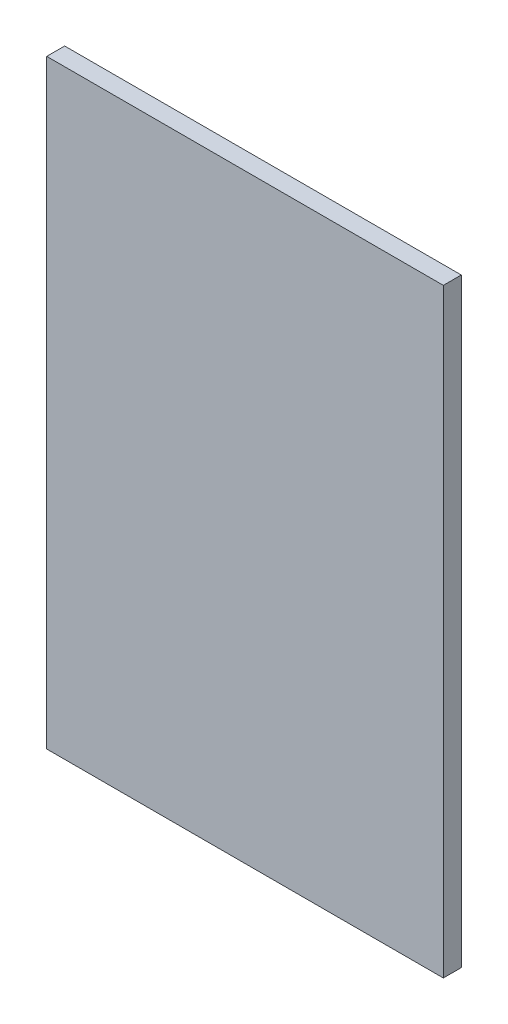
ISO-10303-21;
HEADER;
FILE_DESCRIPTION(('STEP AP214'),'2;1');
FILE_NAME('part.step','',(''),(''),'','','');
FILE_SCHEMA(('AUTOMOTIVE_DESIGN { 1 0 10303 214 1 1 1 1 }'));
ENDSEC;
DATA;
#1=APPLICATION_CONTEXT('core data for automotive mechanical design processes');
#2=APPLICATION_PROTOCOL_DEFINITION('international standard','automotive_design',2000,#1);
#3=PRODUCT_CONTEXT('',#1,'mechanical');
#4=PRODUCT('Part','Part','',(#3));
#5=PRODUCT_RELATED_PRODUCT_CATEGORY('part','',(#4));
#6=PRODUCT_DEFINITION_FORMATION('','',#4);
#7=PRODUCT_DEFINITION_CONTEXT('part definition',#1,'design');
#8=PRODUCT_DEFINITION('design','',#6,#7);
#9=PRODUCT_DEFINITION_SHAPE('','',#8);
#10=(LENGTH_UNIT() NAMED_UNIT(*) SI_UNIT(.MILLI.,.METRE.));
#11=(NAMED_UNIT(*) PLANE_ANGLE_UNIT() SI_UNIT($,.RADIAN.));
#12=(NAMED_UNIT(*) SI_UNIT($,.STERADIAN.) SOLID_ANGLE_UNIT());
#13=UNCERTAINTY_MEASURE_WITH_UNIT(LENGTH_MEASURE(1.E-05),#10,'distance_accuracy_value','');
#14=(GEOMETRIC_REPRESENTATION_CONTEXT(3) GLOBAL_UNCERTAINTY_ASSIGNED_CONTEXT((#13)) GLOBAL_UNIT_ASSIGNED_CONTEXT((#10,
#11,#12)) REPRESENTATION_CONTEXT('',''));
#15=CARTESIAN_POINT('',(0.,0.,0.));
#16=DIRECTION('',(0.,0.,1.));
#17=DIRECTION('',(1.,0.,0.));
#18=AXIS2_PLACEMENT_3D('',#15,#16,#17);
#19=CARTESIAN_POINT('',(-199.,-301.,18.));
#20=DIRECTION('',(1.,0.,0.));
#21=DIRECTION('',(0.,0.,-1.));
#22=AXIS2_PLACEMENT_3D('',#19,#20,#21);
#23=PLANE('',#22);
#24=DIRECTION('',(0.,-1.,0.));
#25=VECTOR('',#24,1.);
#26=CARTESIAN_POINT('',(-199.,-301.,0.));
#27=LINE('',#26,#25);
#28=CARTESIAN_POINT('',(-199.,301.,0.));
#29=VERTEX_POINT('',#28);
#30=CARTESIAN_POINT('',(-199.,-301.,0.));
#31=VERTEX_POINT('',#30);
#32=EDGE_CURVE('E95',#29,#31,#27,.T.);
#33=ORIENTED_EDGE('',*,*,#32,.T.);
#34=DIRECTION('',(0.,0.,-1.));
#35=VECTOR('',#34,1.);
#36=CARTESIAN_POINT('',(-199.,-301.,18.));
#37=LINE('',#36,#35);
#38=CARTESIAN_POINT('',(-199.,-301.,18.));
#39=VERTEX_POINT('',#38);
#40=EDGE_CURVE('E11',#39,#31,#37,.T.);
#41=ORIENTED_EDGE('',*,*,#40,.F.);
#42=DIRECTION('',(0.,-1.,0.));
#43=VECTOR('',#42,1.);
#44=CARTESIAN_POINT('',(-199.,-301.,18.));
#45=LINE('',#44,#43);
#46=CARTESIAN_POINT('',(-199.,301.,18.));
#47=VERTEX_POINT('',#46);
#48=EDGE_CURVE('E83',#47,#39,#45,.T.);
#49=ORIENTED_EDGE('',*,*,#48,.F.);
#50=DIRECTION('',(0.,0.,-1.));
#51=VECTOR('',#50,1.);
#52=CARTESIAN_POINT('',(-199.,301.,18.));
#53=LINE('',#52,#51);
#54=EDGE_CURVE('E91',#47,#29,#53,.T.);
#55=ORIENTED_EDGE('',*,*,#54,.T.);
#56=EDGE_LOOP('',(#33,#41,#49,#55));
#57=FACE_BOUND('',#56,.T.);
#58=ADVANCED_FACE('F32',(#57),#23,.F.);
#59=CARTESIAN_POINT('',(199.,-301.,18.));
#60=DIRECTION('',(0.,1.,0.));
#61=DIRECTION('',(0.,0.,1.));
#62=AXIS2_PLACEMENT_3D('',#59,#60,#61);
#63=PLANE('',#62);
#64=DIRECTION('',(1.,0.,0.));
#65=VECTOR('',#64,1.);
#66=CARTESIAN_POINT('',(199.,-301.,0.));
#67=LINE('',#66,#65);
#68=CARTESIAN_POINT('',(199.,-301.,0.));
#69=VERTEX_POINT('',#68);
#70=EDGE_CURVE('E87',#31,#69,#67,.T.);
#71=ORIENTED_EDGE('',*,*,#70,.T.);
#72=DIRECTION('',(0.,0.,-1.));
#73=VECTOR('',#72,1.);
#74=CARTESIAN_POINT('',(199.,-301.,18.));
#75=LINE('',#74,#73);
#76=CARTESIAN_POINT('',(199.,-301.,18.));
#77=VERTEX_POINT('',#76);
#78=EDGE_CURVE('E40',#77,#69,#75,.T.);
#79=ORIENTED_EDGE('',*,*,#78,.F.);
#80=DIRECTION('',(1.,0.,0.));
#81=VECTOR('',#80,1.);
#82=CARTESIAN_POINT('',(199.,-301.,18.));
#83=LINE('',#82,#81);
#84=EDGE_CURVE('E78',#39,#77,#83,.T.);
#85=ORIENTED_EDGE('',*,*,#84,.F.);
#86=ORIENTED_EDGE('',*,*,#40,.T.);
#87=EDGE_LOOP('',(#71,#79,#85,#86));
#88=FACE_BOUND('',#87,.T.);
#89=ADVANCED_FACE('F86',(#88),#63,.F.);
#90=CARTESIAN_POINT('',(199.,-301.,18.));
#91=DIRECTION('',(-1.,0.,0.));
#92=DIRECTION('',(0.,0.,1.));
#93=AXIS2_PLACEMENT_3D('',#90,#91,#92);
#94=PLANE('',#93);
#95=DIRECTION('',(0.,1.,0.));
#96=VECTOR('',#95,1.);
#97=CARTESIAN_POINT('',(199.,-301.,0.));
#98=LINE('',#97,#96);
#99=CARTESIAN_POINT('',(199.,301.,0.));
#100=VERTEX_POINT('',#99);
#101=EDGE_CURVE('E65',#69,#100,#98,.T.);
#102=ORIENTED_EDGE('',*,*,#101,.T.);
#103=DIRECTION('',(0.,0.,-1.));
#104=VECTOR('',#103,1.);
#105=CARTESIAN_POINT('',(199.,301.,18.));
#106=LINE('',#105,#104);
#107=CARTESIAN_POINT('',(199.,301.,18.));
#108=VERTEX_POINT('',#107);
#109=EDGE_CURVE('E88',#108,#100,#106,.T.);
#110=ORIENTED_EDGE('',*,*,#109,.F.);
#111=DIRECTION('',(0.,1.,0.));
#112=VECTOR('',#111,1.);
#113=CARTESIAN_POINT('',(199.,-301.,18.));
#114=LINE('',#113,#112);
#115=EDGE_CURVE('E81',#77,#108,#114,.T.);
#116=ORIENTED_EDGE('',*,*,#115,.F.);
#117=ORIENTED_EDGE('',*,*,#78,.T.);
#118=EDGE_LOOP('',(#102,#110,#116,#117));
#119=FACE_BOUND('',#118,.T.);
#120=ADVANCED_FACE('F89',(#119),#94,.F.);
#121=CARTESIAN_POINT('',(199.,301.,18.));
#122=DIRECTION('',(0.,-1.,0.));
#123=DIRECTION('',(0.,0.,-1.));
#124=AXIS2_PLACEMENT_3D('',#121,#122,#123);
#125=PLANE('',#124);
#126=DIRECTION('',(-1.,0.,0.));
#127=VECTOR('',#126,1.);
#128=CARTESIAN_POINT('',(199.,301.,0.));
#129=LINE('',#128,#127);
#130=EDGE_CURVE('E71',#100,#29,#129,.T.);
#131=ORIENTED_EDGE('',*,*,#130,.T.);
#132=ORIENTED_EDGE('',*,*,#54,.F.);
#133=DIRECTION('',(-1.,0.,0.));
#134=VECTOR('',#133,1.);
#135=CARTESIAN_POINT('',(199.,301.,18.));
#136=LINE('',#135,#134);
#137=EDGE_CURVE('E48',#108,#47,#136,.T.);
#138=ORIENTED_EDGE('',*,*,#137,.F.);
#139=ORIENTED_EDGE('',*,*,#109,.T.);
#140=EDGE_LOOP('',(#131,#132,#138,#139));
#141=FACE_BOUND('',#140,.T.);
#142=ADVANCED_FACE('F102',(#141),#125,.F.);
#143=CARTESIAN_POINT('',(0.,0.,18.));
#144=DIRECTION('',(0.,0.,1.));
#145=DIRECTION('',(1.,0.,0.));
#146=AXIS2_PLACEMENT_3D('',#143,#144,#145);
#147=PLANE('',#146);
#148=ORIENTED_EDGE('',*,*,#48,.T.);
#149=ORIENTED_EDGE('',*,*,#84,.T.);
#150=ORIENTED_EDGE('',*,*,#115,.T.);
#151=ORIENTED_EDGE('',*,*,#137,.T.);
#152=EDGE_LOOP('',(#148,#149,#150,#151));
#153=FACE_BOUND('',#152,.T.);
#154=ADVANCED_FACE('F79',(#153),#147,.T.);
#155=CARTESIAN_POINT('',(0.,0.,0.));
#156=DIRECTION('',(0.,0.,1.));
#157=DIRECTION('',(1.,0.,0.));
#158=AXIS2_PLACEMENT_3D('',#155,#156,#157);
#159=PLANE('',#158);
#160=ORIENTED_EDGE('',*,*,#32,.F.);
#161=ORIENTED_EDGE('',*,*,#130,.F.);
#162=ORIENTED_EDGE('',*,*,#101,.F.);
#163=ORIENTED_EDGE('',*,*,#70,.F.);
#164=EDGE_LOOP('',(#160,#161,#162,#163));
#165=FACE_BOUND('',#164,.T.);
#166=ADVANCED_FACE('F105',(#165),#159,.F.);
#167=CLOSED_SHELL('',(#58,#89,#120,#142,#154,#166));
#168=MANIFOLD_SOLID_BREP('B2',#167);
#169=ADVANCED_BREP_SHAPE_REPRESENTATION('',(#18,#168),#14);
#170=SHAPE_DEFINITION_REPRESENTATION(#9,#169);
ENDSEC;
END-ISO-10303-21;
